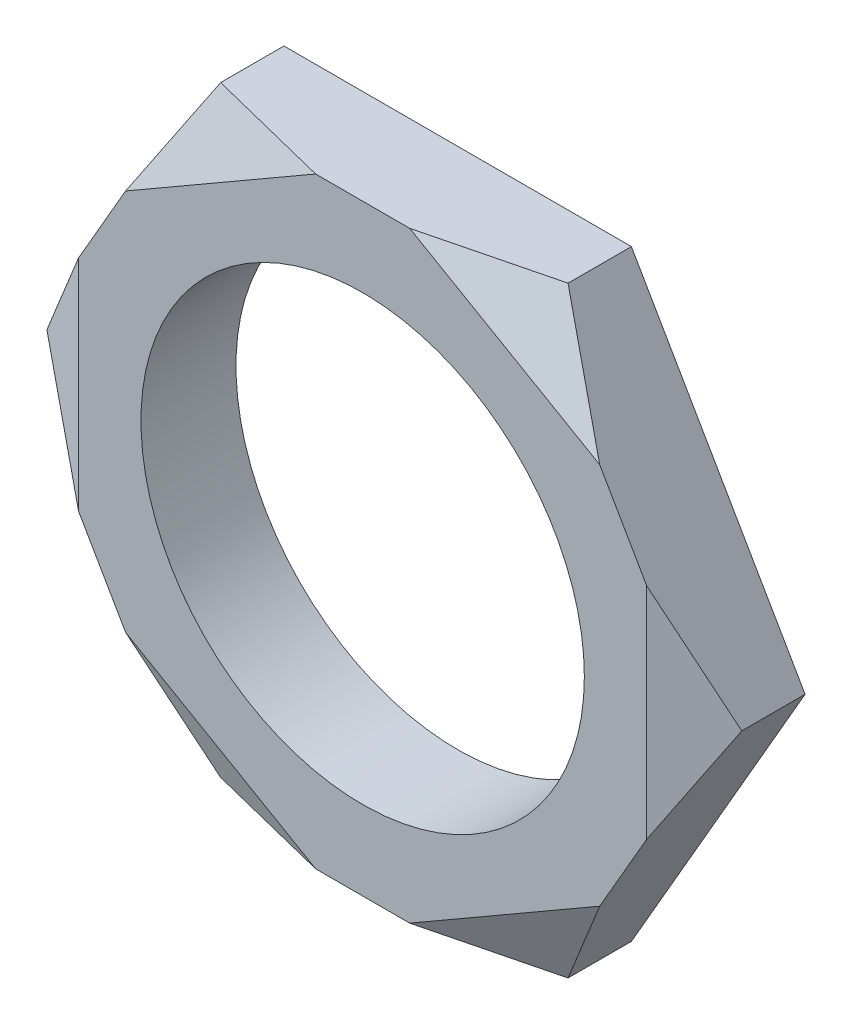
ISO-10303-21;
HEADER;
FILE_DESCRIPTION(('STEP AP214'),'2;1');
FILE_NAME('part.step','',(''),(''),'','','');
FILE_SCHEMA(('AUTOMOTIVE_DESIGN { 1 0 10303 214 1 1 1 1 }'));
ENDSEC;
DATA;
#1=APPLICATION_CONTEXT('core data for automotive mechanical design processes');
#2=APPLICATION_PROTOCOL_DEFINITION('international standard','automotive_design',2000,#1);
#3=PRODUCT_CONTEXT('',#1,'mechanical');
#4=PRODUCT('Part','Part','',(#3));
#5=PRODUCT_RELATED_PRODUCT_CATEGORY('part','',(#4));
#6=PRODUCT_DEFINITION_FORMATION('','',#4);
#7=PRODUCT_DEFINITION_CONTEXT('part definition',#1,'design');
#8=PRODUCT_DEFINITION('design','',#6,#7);
#9=PRODUCT_DEFINITION_SHAPE('','',#8);
#10=(LENGTH_UNIT() NAMED_UNIT(*) SI_UNIT(.MILLI.,.METRE.));
#11=(NAMED_UNIT(*) PLANE_ANGLE_UNIT() SI_UNIT($,.RADIAN.));
#12=(NAMED_UNIT(*) SI_UNIT($,.STERADIAN.) SOLID_ANGLE_UNIT());
#13=UNCERTAINTY_MEASURE_WITH_UNIT(LENGTH_MEASURE(1.E-05),#10,'distance_accuracy_value','');
#14=(GEOMETRIC_REPRESENTATION_CONTEXT(3) GLOBAL_UNCERTAINTY_ASSIGNED_CONTEXT((#13)) GLOBAL_UNIT_ASSIGNED_CONTEXT((#10,
#11,#12)) REPRESENTATION_CONTEXT('',''));
#15=CARTESIAN_POINT('',(0.,0.,0.));
#16=DIRECTION('',(0.,0.,1.));
#17=DIRECTION('',(1.,0.,0.));
#18=AXIS2_PLACEMENT_3D('',#15,#16,#17);
#19=CARTESIAN_POINT('',(0.,0.,1.5));
#20=DIRECTION('',(0.,0.,1.));
#21=DIRECTION('',(1.,0.,0.));
#22=AXIS2_PLACEMENT_3D('',#19,#20,#21);
#23=PLANE('',#22);
#24=CARTESIAN_POINT('',(0.,0.,1.5));
#25=DIRECTION('',(0.,0.,1.));
#26=DIRECTION('',(1.,0.,0.));
#27=AXIS2_PLACEMENT_3D('',#24,#25,#26);
#28=CIRCLE('',#27,3.5);
#29=CARTESIAN_POINT('',(3.5,0.,1.5));
#30=VERTEX_POINT('',#29);
#31=EDGE_CURVE('E215',#30,#30,#28,.T.);
#32=ORIENTED_EDGE('',*,*,#31,.F.);
#33=EDGE_LOOP('',(#32));
#34=FACE_BOUND('',#33,.T.);
#35=DIRECTION('',(-0.499999999999995,-0.866025403784442,0.));
#36=VECTOR('',#35,1.);
#37=CARTESIAN_POINT('',(-2.74241377865078,4.74999999999997,1.5));
#38=LINE('',#37,#36);
#39=CARTESIAN_POINT('',(-3.74241377865077,3.01794919243109,1.5));
#40=VERTEX_POINT('',#39);
#41=CARTESIAN_POINT('',(-4.48482755730146,1.73205080756889,1.5));
#42=VERTEX_POINT('',#41);
#43=EDGE_CURVE('E128',#40,#42,#38,.T.);
#44=ORIENTED_EDGE('',*,*,#43,.T.);
#45=DIRECTION('',(0.,-1.,0.));
#46=VECTOR('',#45,1.);
#47=CARTESIAN_POINT('',(-4.48482755730145,0.,1.5));
#48=LINE('',#47,#46);
#49=CARTESIAN_POINT('',(-4.48482755730145,-1.73205080756888,1.5));
#50=VERTEX_POINT('',#49);
#51=EDGE_CURVE('E131',#42,#50,#48,.T.);
#52=ORIENTED_EDGE('',*,*,#51,.T.);
#53=DIRECTION('',(0.500000000000001,-0.866025403784438,0.));
#54=VECTOR('',#53,1.);
#55=CARTESIAN_POINT('',(-5.48482755730145,0.,1.5));
#56=LINE('',#55,#54);
#57=CARTESIAN_POINT('',(-3.74241377865071,-3.01794919243114,1.5));
#58=VERTEX_POINT('',#57);
#59=EDGE_CURVE('E118',#50,#58,#56,.T.);
#60=ORIENTED_EDGE('',*,*,#59,.T.);
#61=DIRECTION('',(0.866025403784441,-0.499999999999997,0.));
#62=VECTOR('',#61,1.);
#63=CARTESIAN_POINT('',(-2.24241377865071,-3.88397459621557,1.5));
#64=LINE('',#63,#62);
#65=CARTESIAN_POINT('',(-0.742413778650717,-4.74999999999999,1.5));
#66=VERTEX_POINT('',#65);
#67=EDGE_CURVE('E141',#58,#66,#64,.T.);
#68=ORIENTED_EDGE('',*,*,#67,.T.);
#69=DIRECTION('',(1.,0.,0.));
#70=VECTOR('',#69,1.);
#71=CARTESIAN_POINT('',(-2.74241377865071,-4.75000000000001,1.5));
#72=LINE('',#71,#70);
#73=CARTESIAN_POINT('',(0.742413778650777,-4.74999999999998,1.5));
#74=VERTEX_POINT('',#73);
#75=EDGE_CURVE('E127',#66,#74,#72,.T.);
#76=ORIENTED_EDGE('',*,*,#75,.T.);
#77=DIRECTION('',(0.866025403784434,0.500000000000008,0.));
#78=VECTOR('',#77,1.);
#79=CARTESIAN_POINT('',(2.24241377865076,-3.88397459621554,1.5));
#80=LINE('',#79,#78);
#81=CARTESIAN_POINT('',(3.74241377865075,-3.01794919243108,1.5));
#82=VERTEX_POINT('',#81);
#83=EDGE_CURVE('E149',#74,#82,#80,.T.);
#84=ORIENTED_EDGE('',*,*,#83,.T.);
#85=DIRECTION('',(0.499999999999991,0.866025403784444,0.));
#86=VECTOR('',#85,1.);
#87=CARTESIAN_POINT('',(2.74241377865077,-4.74999999999997,1.5));
#88=LINE('',#87,#86);
#89=CARTESIAN_POINT('',(4.48482755730146,-1.73205080756883,1.5));
#90=VERTEX_POINT('',#89);
#91=EDGE_CURVE('E211',#82,#90,#88,.T.);
#92=ORIENTED_EDGE('',*,*,#91,.T.);
#93=DIRECTION('',(0.,1.,0.));
#94=VECTOR('',#93,1.);
#95=CARTESIAN_POINT('',(4.48482755730144,0.,1.5));
#96=LINE('',#95,#94);
#97=CARTESIAN_POINT('',(4.48482755730142,1.73205080756893,1.5));
#98=VERTEX_POINT('',#97);
#99=EDGE_CURVE('E158',#90,#98,#96,.T.);
#100=ORIENTED_EDGE('',*,*,#99,.T.);
#101=DIRECTION('',(-0.500000000000009,0.866025403784433,0.));
#102=VECTOR('',#101,1.);
#103=CARTESIAN_POINT('',(5.48482755730145,0.,1.5));
#104=LINE('',#103,#102);
#105=CARTESIAN_POINT('',(3.74241377865069,3.01794919243117,1.5));
#106=VERTEX_POINT('',#105);
#107=EDGE_CURVE('E209',#98,#106,#104,.T.);
#108=ORIENTED_EDGE('',*,*,#107,.T.);
#109=DIRECTION('',(-0.866025403784444,0.499999999999991,0.));
#110=VECTOR('',#109,1.);
#111=CARTESIAN_POINT('',(2.24241377865068,3.88397459621559,1.5));
#112=LINE('',#111,#110);
#113=CARTESIAN_POINT('',(0.742413778650676,4.75000000000001,1.5));
#114=VERTEX_POINT('',#113);
#115=EDGE_CURVE('E167',#106,#114,#112,.T.);
#116=ORIENTED_EDGE('',*,*,#115,.T.);
#117=DIRECTION('',(-1.,0.,0.));
#118=VECTOR('',#117,1.);
#119=CARTESIAN_POINT('',(2.74241377865067,4.75000000000003,1.5));
#120=LINE('',#119,#118);
#121=CARTESIAN_POINT('',(-0.742413778650786,4.74999999999999,1.5));
#122=VERTEX_POINT('',#121);
#123=EDGE_CURVE('E188',#114,#122,#120,.T.);
#124=ORIENTED_EDGE('',*,*,#123,.T.);
#125=DIRECTION('',(-0.866025403784434,-0.500000000000007,0.));
#126=VECTOR('',#125,1.);
#127=CARTESIAN_POINT('',(-2.24241377865076,3.88397459621555,1.5));
#128=LINE('',#127,#126);
#129=EDGE_CURVE('E170',#122,#40,#128,.T.);
#130=ORIENTED_EDGE('',*,*,#129,.T.);
#131=EDGE_LOOP('',(#44,#52,#60,#68,#76,#84,#92,#100,#108,#116,#124,#130));
#132=FACE_BOUND('',#131,.T.);
#133=ADVANCED_FACE('F33',(#34,#132),#23,.T.);
#134=CARTESIAN_POINT('',(-2.74241377865078,4.74999999999997,1.5));
#135=DIRECTION('',(0.866025403784441,-0.499999999999995,0.));
#136=DIRECTION('',(0.499999999999995,0.866025403784442,0.));
#137=AXIS2_PLACEMENT_3D('',#134,#135,#136);
#138=PLANE('',#137);
#139=DIRECTION('',(-0.485071250072661,-0.840168050416809,-0.242535625036333));
#140=VECTOR('',#139,1.);
#141=CARTESIAN_POINT('',(-2.8449087068067,4.57247357691579,2.31995942524739));
#142=LINE('',#141,#140);
#143=CARTESIAN_POINT('',(-5.48482755730145,0.,1.));
#144=VERTEX_POINT('',#143);
#145=EDGE_CURVE('E41',#42,#144,#142,.T.);
#146=ORIENTED_EDGE('',*,*,#145,.F.);
#147=ORIENTED_EDGE('',*,*,#43,.F.);
#148=DIRECTION('',(-0.485071250072661,-0.840168050416809,0.242535625036333));
#149=VECTOR('',#148,1.);
#150=CARTESIAN_POINT('',(-2.80123730806254,4.64811465837827,1.02941176470588));
#151=LINE('',#150,#149);
#152=CARTESIAN_POINT('',(-2.74241377865078,4.74999999999997,1.));
#153=VERTEX_POINT('',#152);
#154=EDGE_CURVE('E174',#153,#40,#151,.T.);
#155=ORIENTED_EDGE('',*,*,#154,.F.);
#156=DIRECTION('',(0.,0.,-1.));
#157=VECTOR('',#156,1.);
#158=CARTESIAN_POINT('',(-2.74241377865078,4.74999999999997,1.5));
#159=LINE('',#158,#157);
#160=CARTESIAN_POINT('',(-2.74241377865078,4.74999999999997,0.));
#161=VERTEX_POINT('',#160);
#162=EDGE_CURVE('E186',#153,#161,#159,.T.);
#163=ORIENTED_EDGE('',*,*,#162,.T.);
#164=DIRECTION('',(-0.499999999999995,-0.866025403784442,0.));
#165=VECTOR('',#164,1.);
#166=CARTESIAN_POINT('',(-2.74241377865078,4.74999999999997,0.));
#167=LINE('',#166,#165);
#168=CARTESIAN_POINT('',(-5.48482755730145,0.,0.));
#169=VERTEX_POINT('',#168);
#170=EDGE_CURVE('E204',#161,#169,#167,.T.);
#171=ORIENTED_EDGE('',*,*,#170,.T.);
#172=DIRECTION('',(0.,0.,-1.));
#173=VECTOR('',#172,1.);
#174=CARTESIAN_POINT('',(-5.48482755730145,0.,1.5));
#175=LINE('',#174,#173);
#176=EDGE_CURVE('E176',#144,#169,#175,.T.);
#177=ORIENTED_EDGE('',*,*,#176,.F.);
#178=EDGE_LOOP('',(#146,#147,#155,#163,#171,#177));
#179=FACE_BOUND('',#178,.T.);
#180=ADVANCED_FACE('F35',(#179),#138,.F.);
#181=CARTESIAN_POINT('',(-5.48482755730145,0.,1.5));
#182=DIRECTION('',(0.866025403784438,0.500000000000001,0.));
#183=DIRECTION('',(-0.500000000000001,0.866025403784438,0.));
#184=AXIS2_PLACEMENT_3D('',#181,#182,#183);
#185=PLANE('',#184);
#186=DIRECTION('',(0.485071250072667,-0.840168050416805,0.242535625036333));
#187=VECTOR('',#186,1.);
#188=CARTESIAN_POINT('',(-5.42600402788968,-0.101885341621699,1.02941176470588));
#189=LINE('',#188,#187);
#190=EDGE_CURVE('E11',#144,#50,#189,.T.);
#191=ORIENTED_EDGE('',*,*,#190,.F.);
#192=ORIENTED_EDGE('',*,*,#176,.T.);
#193=DIRECTION('',(0.500000000000001,-0.866025403784438,0.));
#194=VECTOR('',#193,1.);
#195=CARTESIAN_POINT('',(-5.48482755730145,0.,0.));
#196=LINE('',#195,#194);
#197=CARTESIAN_POINT('',(-2.74241377865071,-4.75000000000001,0.));
#198=VERTEX_POINT('',#197);
#199=EDGE_CURVE('E201',#169,#198,#196,.T.);
#200=ORIENTED_EDGE('',*,*,#199,.T.);
#201=DIRECTION('',(0.,0.,-1.));
#202=VECTOR('',#201,1.);
#203=CARTESIAN_POINT('',(-2.74241377865071,-4.75000000000001,1.5));
#204=LINE('',#203,#202);
#205=CARTESIAN_POINT('',(-2.74241377865071,-4.75000000000001,1.));
#206=VERTEX_POINT('',#205);
#207=EDGE_CURVE('E178',#206,#198,#204,.T.);
#208=ORIENTED_EDGE('',*,*,#207,.F.);
#209=DIRECTION('',(0.485071250072667,-0.840168050416805,-0.242535625036333));
#210=VECTOR('',#209,1.);
#211=CARTESIAN_POINT('',(-5.38233262914552,-0.177526423084184,2.3199594252474));
#212=LINE('',#211,#210);
#213=EDGE_CURVE('E123',#58,#206,#212,.T.);
#214=ORIENTED_EDGE('',*,*,#213,.F.);
#215=ORIENTED_EDGE('',*,*,#59,.F.);
#216=EDGE_LOOP('',(#191,#192,#200,#208,#214,#215));
#217=FACE_BOUND('',#216,.T.);
#218=ADVANCED_FACE('F120',(#217),#185,.F.);
#219=CARTESIAN_POINT('',(-2.74241377865071,-4.75000000000001,1.5));
#220=DIRECTION('',(0.,1.,0.));
#221=DIRECTION('',(-1.,0.,0.));
#222=AXIS2_PLACEMENT_3D('',#219,#220,#221);
#223=PLANE('',#222);
#224=DIRECTION('',(0.970142500145332,0.,0.242535625036333));
#225=VECTOR('',#224,1.);
#226=CARTESIAN_POINT('',(-2.62476671982718,-4.75000000000001,1.02941176470588));
#227=LINE('',#226,#225);
#228=EDGE_CURVE('E134',#206,#66,#227,.T.);
#229=ORIENTED_EDGE('',*,*,#228,.F.);
#230=ORIENTED_EDGE('',*,*,#207,.T.);
#231=DIRECTION('',(1.,0.,0.));
#232=VECTOR('',#231,1.);
#233=CARTESIAN_POINT('',(-2.74241377865071,-4.75000000000001,0.));
#234=LINE('',#233,#232);
#235=CARTESIAN_POINT('',(2.74241377865077,-4.74999999999997,0.));
#236=VERTEX_POINT('',#235);
#237=EDGE_CURVE('E198',#198,#236,#234,.T.);
#238=ORIENTED_EDGE('',*,*,#237,.T.);
#239=DIRECTION('',(0.,0.,-1.));
#240=VECTOR('',#239,1.);
#241=CARTESIAN_POINT('',(2.74241377865077,-4.74999999999997,1.5));
#242=LINE('',#241,#240);
#243=CARTESIAN_POINT('',(2.74241377865077,-4.74999999999997,1.));
#244=VERTEX_POINT('',#243);
#245=EDGE_CURVE('E180',#244,#236,#242,.T.);
#246=ORIENTED_EDGE('',*,*,#245,.F.);
#247=DIRECTION('',(0.970142500145332,0.,-0.242535625036333));
#248=VECTOR('',#247,1.);
#249=CARTESIAN_POINT('',(-2.53742392233886,-4.75000000000001,2.31995942524741));
#250=LINE('',#249,#248);
#251=EDGE_CURVE('E146',#74,#244,#250,.T.);
#252=ORIENTED_EDGE('',*,*,#251,.F.);
#253=ORIENTED_EDGE('',*,*,#75,.F.);
#254=EDGE_LOOP('',(#229,#230,#238,#246,#252,#253));
#255=FACE_BOUND('',#254,.T.);
#256=ADVANCED_FACE('F252',(#255),#223,.F.);
#257=CARTESIAN_POINT('',(2.74241377865077,-4.74999999999997,1.5));
#258=DIRECTION('',(-0.866025403784444,0.499999999999991,0.));
#259=DIRECTION('',(-0.499999999999991,-0.866025403784444,0.));
#260=AXIS2_PLACEMENT_3D('',#257,#258,#259);
#261=PLANE('',#260);
#262=DIRECTION('',(0.485071250072657,0.840168050416811,0.242535625036333));
#263=VECTOR('',#262,1.);
#264=CARTESIAN_POINT('',(2.80123730806254,-4.64811465837827,1.02941176470588));
#265=LINE('',#264,#263);
#266=EDGE_CURVE('E143',#244,#82,#265,.T.);
#267=ORIENTED_EDGE('',*,*,#266,.F.);
#268=ORIENTED_EDGE('',*,*,#245,.T.);
#269=DIRECTION('',(0.499999999999991,0.866025403784444,0.));
#270=VECTOR('',#269,1.);
#271=CARTESIAN_POINT('',(2.74241377865077,-4.74999999999997,0.));
#272=LINE('',#271,#270);
#273=CARTESIAN_POINT('',(5.48482755730145,0.,0.));
#274=VERTEX_POINT('',#273);
#275=EDGE_CURVE('E195',#236,#274,#272,.T.);
#276=ORIENTED_EDGE('',*,*,#275,.T.);
#277=DIRECTION('',(0.,0.,-1.));
#278=VECTOR('',#277,1.);
#279=CARTESIAN_POINT('',(5.48482755730145,0.,1.5));
#280=LINE('',#279,#278);
#281=CARTESIAN_POINT('',(5.48482755730145,0.,0.999999999999999));
#282=VERTEX_POINT('',#281);
#283=EDGE_CURVE('E182',#282,#274,#280,.T.);
#284=ORIENTED_EDGE('',*,*,#283,.F.);
#285=DIRECTION('',(0.485071250072657,0.840168050416811,-0.242535625036333));
#286=VECTOR('',#285,1.);
#287=CARTESIAN_POINT('',(2.8449087068067,-4.57247357691578,2.3199594252474));
#288=LINE('',#287,#286);
#289=EDGE_CURVE('E155',#90,#282,#288,.T.);
#290=ORIENTED_EDGE('',*,*,#289,.F.);
#291=ORIENTED_EDGE('',*,*,#91,.F.);
#292=EDGE_LOOP('',(#267,#268,#276,#284,#290,#291));
#293=FACE_BOUND('',#292,.T.);
#294=ADVANCED_FACE('F248',(#293),#261,.F.);
#295=CARTESIAN_POINT('',(5.48482755730145,0.,1.5));
#296=DIRECTION('',(-0.866025403784433,-0.500000000000009,0.));
#297=DIRECTION('',(0.500000000000009,-0.866025403784433,0.));
#298=AXIS2_PLACEMENT_3D('',#295,#296,#297);
#299=PLANE('',#298);
#300=DIRECTION('',(-0.485071250072675,0.840168050416801,0.242535625036333));
#301=VECTOR('',#300,1.);
#302=CARTESIAN_POINT('',(5.42600402788968,0.101885341621758,1.02941176470588));
#303=LINE('',#302,#301);
#304=EDGE_CURVE('E152',#282,#98,#303,.T.);
#305=ORIENTED_EDGE('',*,*,#304,.F.);
#306=ORIENTED_EDGE('',*,*,#283,.T.);
#307=DIRECTION('',(-0.500000000000009,0.866025403784433,0.));
#308=VECTOR('',#307,1.);
#309=CARTESIAN_POINT('',(5.48482755730145,0.,0.));
#310=LINE('',#309,#308);
#311=CARTESIAN_POINT('',(2.74241377865067,4.75000000000003,0.));
#312=VERTEX_POINT('',#311);
#313=EDGE_CURVE('E192',#274,#312,#310,.T.);
#314=ORIENTED_EDGE('',*,*,#313,.T.);
#315=DIRECTION('',(0.,0.,-1.));
#316=VECTOR('',#315,1.);
#317=CARTESIAN_POINT('',(2.74241377865067,4.75000000000003,1.5));
#318=LINE('',#317,#316);
#319=CARTESIAN_POINT('',(2.74241377865067,4.75000000000003,1.));
#320=VERTEX_POINT('',#319);
#321=EDGE_CURVE('E184',#320,#312,#318,.T.);
#322=ORIENTED_EDGE('',*,*,#321,.F.);
#323=DIRECTION('',(-0.485071250072675,0.840168050416801,-0.242535625036333));
#324=VECTOR('',#323,1.);
#325=CARTESIAN_POINT('',(5.38233262914552,0.177526423084243,2.3199594252474));
#326=LINE('',#325,#324);
#327=EDGE_CURVE('E164',#106,#320,#326,.T.);
#328=ORIENTED_EDGE('',*,*,#327,.F.);
#329=ORIENTED_EDGE('',*,*,#107,.F.);
#330=EDGE_LOOP('',(#305,#306,#314,#322,#328,#329));
#331=FACE_BOUND('',#330,.T.);
#332=ADVANCED_FACE('F244',(#331),#299,.F.);
#333=CARTESIAN_POINT('',(2.74241377865067,4.75000000000003,1.5));
#334=DIRECTION('',(0.,-1.,0.));
#335=DIRECTION('',(1.,0.,0.));
#336=AXIS2_PLACEMENT_3D('',#333,#334,#335);
#337=PLANE('',#336);
#338=DIRECTION('',(-0.970142500145332,0.,0.242535625036333));
#339=VECTOR('',#338,1.);
#340=CARTESIAN_POINT('',(2.62476671982714,4.75000000000003,1.02941176470588));
#341=LINE('',#340,#339);
#342=EDGE_CURVE('E161',#320,#114,#341,.T.);
#343=ORIENTED_EDGE('',*,*,#342,.F.);
#344=ORIENTED_EDGE('',*,*,#321,.T.);
#345=DIRECTION('',(-1.,0.,0.));
#346=VECTOR('',#345,1.);
#347=CARTESIAN_POINT('',(2.74241377865067,4.75000000000003,0.));
#348=LINE('',#347,#346);
#349=EDGE_CURVE('E189',#312,#161,#348,.T.);
#350=ORIENTED_EDGE('',*,*,#349,.T.);
#351=ORIENTED_EDGE('',*,*,#162,.F.);
#352=DIRECTION('',(-0.970142500145332,0.,-0.242535625036333));
#353=VECTOR('',#352,1.);
#354=CARTESIAN_POINT('',(2.53742392233882,4.75000000000003,2.3199594252474));
#355=LINE('',#354,#353);
#356=EDGE_CURVE('E172',#122,#153,#355,.T.);
#357=ORIENTED_EDGE('',*,*,#356,.F.);
#358=ORIENTED_EDGE('',*,*,#123,.F.);
#359=EDGE_LOOP('',(#343,#344,#350,#351,#357,#358));
#360=FACE_BOUND('',#359,.T.);
#361=ADVANCED_FACE('F241',(#360),#337,.F.);
#362=CARTESIAN_POINT('',(0.,0.,0.));
#363=DIRECTION('',(0.,0.,1.));
#364=DIRECTION('',(1.,0.,0.));
#365=AXIS2_PLACEMENT_3D('',#362,#363,#364);
#366=PLANE('',#365);
#367=CARTESIAN_POINT('',(0.,0.,0.));
#368=DIRECTION('',(0.,0.,1.));
#369=DIRECTION('',(1.,0.,0.));
#370=AXIS2_PLACEMENT_3D('',#367,#368,#369);
#371=CIRCLE('',#370,3.5);
#372=CARTESIAN_POINT('',(3.5,0.,0.));
#373=VERTEX_POINT('',#372);
#374=EDGE_CURVE('E207',#373,#373,#371,.T.);
#375=ORIENTED_EDGE('',*,*,#374,.T.);
#376=EDGE_LOOP('',(#375));
#377=FACE_BOUND('',#376,.T.);
#378=ORIENTED_EDGE('',*,*,#170,.F.);
#379=ORIENTED_EDGE('',*,*,#349,.F.);
#380=ORIENTED_EDGE('',*,*,#313,.F.);
#381=ORIENTED_EDGE('',*,*,#275,.F.);
#382=ORIENTED_EDGE('',*,*,#237,.F.);
#383=ORIENTED_EDGE('',*,*,#199,.F.);
#384=EDGE_LOOP('',(#378,#379,#380,#381,#382,#383));
#385=FACE_BOUND('',#384,.T.);
#386=ADVANCED_FACE('F221',(#377,#385),#366,.F.);
#387=CARTESIAN_POINT('',(0.,0.,0.));
#388=DIRECTION('',(0.,0.,1.));
#389=DIRECTION('',(1.,0.,0.));
#390=AXIS2_PLACEMENT_3D('',#387,#388,#389);
#391=CYLINDRICAL_SURFACE('',#390,3.5);
#392=ORIENTED_EDGE('',*,*,#374,.F.);
#393=EDGE_LOOP('',(#392));
#394=FACE_BOUND('',#393,.T.);
#395=ORIENTED_EDGE('',*,*,#31,.T.);
#396=EDGE_LOOP('',(#395));
#397=FACE_BOUND('',#396,.T.);
#398=ADVANCED_FACE('F224',(#394,#397),#391,.F.);
#399=CARTESIAN_POINT('',(-0.74848275573016,1.29641016151378,2.99393102292058));
#400=DIRECTION('',(-0.223606797749983,0.387298334620741,0.894427190999915));
#401=DIRECTION('',(0.,-0.917662935482247,0.397359707119513));
#402=AXIS2_PLACEMENT_3D('',#399,#400,#401);
#403=PLANE('',#402);
#404=ORIENTED_EDGE('',*,*,#356,.T.);
#405=ORIENTED_EDGE('',*,*,#154,.T.);
#406=ORIENTED_EDGE('',*,*,#129,.F.);
#407=EDGE_LOOP('',(#404,#405,#406));
#408=FACE_BOUND('',#407,.T.);
#409=ADVANCED_FACE('F227',(#408),#403,.T.);
#410=CARTESIAN_POINT('',(0.748482755730131,1.29641016151378,2.99393102292058));
#411=DIRECTION('',(0.223606797749975,0.387298334620744,0.894427190999916));
#412=DIRECTION('',(0.,-0.917662935482246,0.397359707119515));
#413=AXIS2_PLACEMENT_3D('',#410,#411,#412);
#414=PLANE('',#413);
#415=ORIENTED_EDGE('',*,*,#115,.F.);
#416=ORIENTED_EDGE('',*,*,#327,.T.);
#417=ORIENTED_EDGE('',*,*,#342,.T.);
#418=EDGE_LOOP('',(#415,#416,#417));
#419=FACE_BOUND('',#418,.T.);
#420=ADVANCED_FACE('F293',(#419),#414,.T.);
#421=CARTESIAN_POINT('',(1.49696551146029,0.,2.99393102292058));
#422=DIRECTION('',(0.447213595499958,0.,0.894427190999916));
#423=DIRECTION('',(0.894427190999916,0.,-0.447213595499958));
#424=AXIS2_PLACEMENT_3D('',#421,#422,#423);
#425=PLANE('',#424);
#426=ORIENTED_EDGE('',*,*,#99,.F.);
#427=ORIENTED_EDGE('',*,*,#289,.T.);
#428=ORIENTED_EDGE('',*,*,#304,.T.);
#429=EDGE_LOOP('',(#426,#427,#428));
#430=FACE_BOUND('',#429,.T.);
#431=ADVANCED_FACE('F285',(#430),#425,.T.);
#432=CARTESIAN_POINT('',(0.748482755730153,-1.29641016151376,2.99393102292057));
#433=DIRECTION('',(0.223606797749982,-0.387298334620739,0.894427190999916));
#434=DIRECTION('',(0.,-0.917662935482248,-0.39735970711951));
#435=AXIS2_PLACEMENT_3D('',#432,#433,#434);
#436=PLANE('',#435);
#437=ORIENTED_EDGE('',*,*,#83,.F.);
#438=ORIENTED_EDGE('',*,*,#251,.T.);
#439=ORIENTED_EDGE('',*,*,#266,.T.);
#440=EDGE_LOOP('',(#437,#438,#439));
#441=FACE_BOUND('',#440,.T.);
#442=ADVANCED_FACE('F277',(#441),#436,.T.);
#443=CARTESIAN_POINT('',(-0.748482755730134,-1.29641016151377,2.99393102292057));
#444=DIRECTION('',(-0.223606797749976,-0.387298334620741,0.894427190999917));
#445=DIRECTION('',(0.,-0.917662935482248,-0.397359707119512));
#446=AXIS2_PLACEMENT_3D('',#443,#444,#445);
#447=PLANE('',#446);
#448=ORIENTED_EDGE('',*,*,#67,.F.);
#449=ORIENTED_EDGE('',*,*,#213,.T.);
#450=ORIENTED_EDGE('',*,*,#228,.T.);
#451=EDGE_LOOP('',(#448,#449,#450));
#452=FACE_BOUND('',#451,.T.);
#453=ADVANCED_FACE('F268',(#452),#447,.T.);
#454=CARTESIAN_POINT('',(-1.4969655114603,0.,2.99393102292058));
#455=DIRECTION('',(-0.447213595499959,0.,0.894427190999915));
#456=DIRECTION('',(0.894427190999915,0.,0.447213595499959));
#457=AXIS2_PLACEMENT_3D('',#454,#455,#456);
#458=PLANE('',#457);
#459=ORIENTED_EDGE('',*,*,#51,.F.);
#460=ORIENTED_EDGE('',*,*,#145,.T.);
#461=ORIENTED_EDGE('',*,*,#190,.T.);
#462=EDGE_LOOP('',(#459,#460,#461));
#463=FACE_BOUND('',#462,.T.);
#464=ADVANCED_FACE('F136',(#463),#458,.T.);
#465=CLOSED_SHELL('',(#133,#180,#218,#256,#294,#332,#361,#386,#398,#409,#420,#431,#442,#453,#464));
#466=MANIFOLD_SOLID_BREP('B2',#465);
#467=ADVANCED_BREP_SHAPE_REPRESENTATION('',(#18,#466),#14);
#468=SHAPE_DEFINITION_REPRESENTATION(#9,#467);
ENDSEC;
END-ISO-10303-21;
